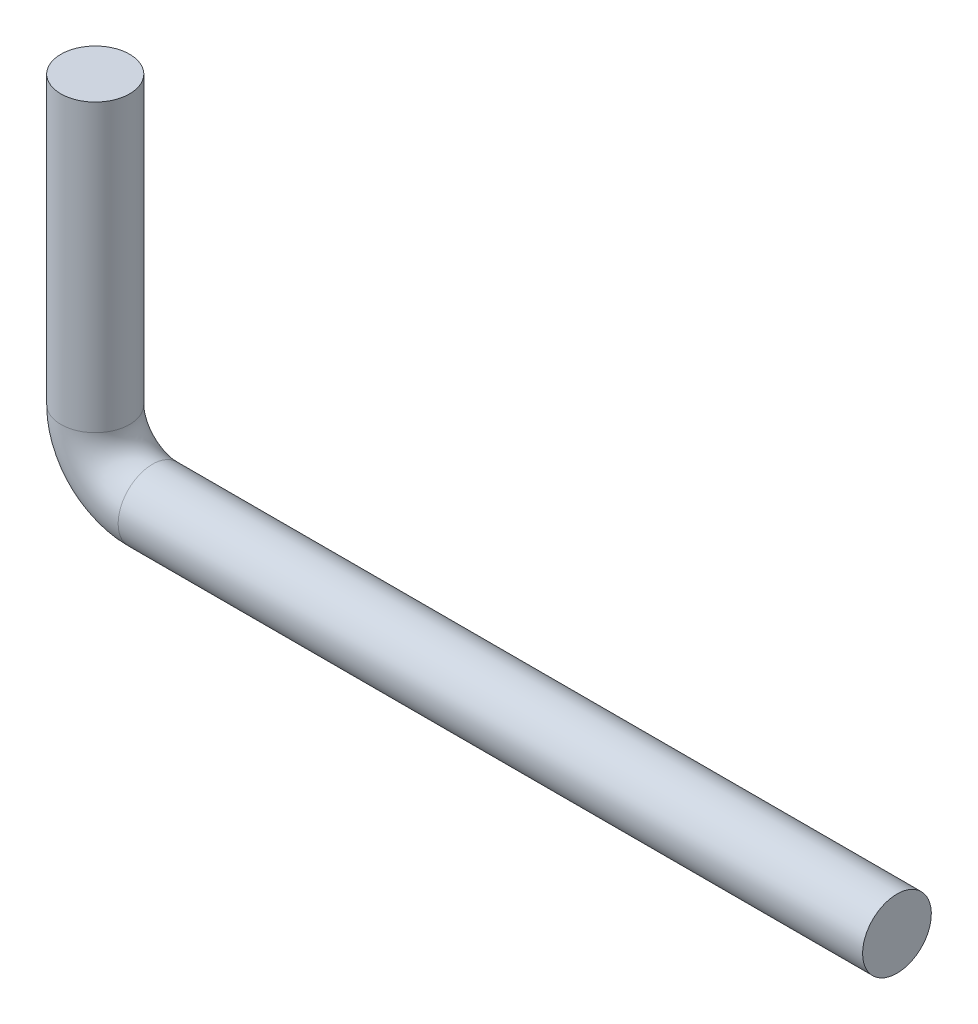
ISO-10303-21;
HEADER;
FILE_DESCRIPTION(('STEP AP214'),'2;1');
FILE_NAME('part.step','',(''),(''),'','','');
FILE_SCHEMA(('AUTOMOTIVE_DESIGN { 1 0 10303 214 1 1 1 1 }'));
ENDSEC;
DATA;
#1=APPLICATION_CONTEXT('core data for automotive mechanical design processes');
#2=APPLICATION_PROTOCOL_DEFINITION('international standard','automotive_design',2000,#1);
#3=PRODUCT_CONTEXT('',#1,'mechanical');
#4=PRODUCT('Part','Part','',(#3));
#5=PRODUCT_RELATED_PRODUCT_CATEGORY('part','',(#4));
#6=PRODUCT_DEFINITION_FORMATION('','',#4);
#7=PRODUCT_DEFINITION_CONTEXT('part definition',#1,'design');
#8=PRODUCT_DEFINITION('design','',#6,#7);
#9=PRODUCT_DEFINITION_SHAPE('','',#8);
#10=(LENGTH_UNIT() NAMED_UNIT(*) SI_UNIT(.MILLI.,.METRE.));
#11=(NAMED_UNIT(*) PLANE_ANGLE_UNIT() SI_UNIT($,.RADIAN.));
#12=(NAMED_UNIT(*) SI_UNIT($,.STERADIAN.) SOLID_ANGLE_UNIT());
#13=UNCERTAINTY_MEASURE_WITH_UNIT(LENGTH_MEASURE(1.E-05),#10,'distance_accuracy_value','');
#14=(GEOMETRIC_REPRESENTATION_CONTEXT(3) GLOBAL_UNCERTAINTY_ASSIGNED_CONTEXT((#13)) GLOBAL_UNIT_ASSIGNED_CONTEXT((#10,
#11,#12)) REPRESENTATION_CONTEXT('',''));
#15=CARTESIAN_POINT('',(0.,0.,0.));
#16=DIRECTION('',(0.,0.,1.));
#17=DIRECTION('',(1.,0.,0.));
#18=AXIS2_PLACEMENT_3D('',#15,#16,#17);
#19=CARTESIAN_POINT('',(0.,60.,0.));
#20=DIRECTION('',(0.,1.,0.));
#21=DIRECTION('',(0.,0.,1.));
#22=AXIS2_PLACEMENT_3D('',#19,#20,#21);
#23=PLANE('',#22);
#24=CARTESIAN_POINT('',(0.,60.,0.));
#25=DIRECTION('',(0.,1.,0.));
#26=DIRECTION('',(0.,0.,1.));
#27=AXIS2_PLACEMENT_3D('',#24,#25,#26);
#28=CIRCLE('',#27,6.);
#29=CARTESIAN_POINT('',(0.,60.,6.));
#30=VERTEX_POINT('',#29);
#31=EDGE_CURVE('E48',#30,#30,#28,.T.);
#32=ORIENTED_EDGE('',*,*,#31,.T.);
#33=EDGE_LOOP('',(#32));
#34=FACE_BOUND('',#33,.T.);
#35=ADVANCED_FACE('F34',(#34),#23,.T.);
#36=CARTESIAN_POINT('',(140.,0.,0.));
#37=DIRECTION('',(-1.,0.,0.));
#38=DIRECTION('',(0.,0.,1.));
#39=AXIS2_PLACEMENT_3D('',#36,#37,#38);
#40=PLANE('',#39);
#41=CARTESIAN_POINT('',(140.,0.,0.));
#42=DIRECTION('',(-1.,0.,0.));
#43=DIRECTION('',(0.,0.,1.));
#44=AXIS2_PLACEMENT_3D('',#41,#42,#43);
#45=CIRCLE('',#44,6.);
#46=CARTESIAN_POINT('',(140.,0.,6.));
#47=VERTEX_POINT('',#46);
#48=EDGE_CURVE('E10',#47,#47,#45,.T.);
#49=ORIENTED_EDGE('',*,*,#48,.F.);
#50=EDGE_LOOP('',(#49));
#51=FACE_BOUND('',#50,.T.);
#52=ADVANCED_FACE('F58',(#51),#40,.F.);
#53=CARTESIAN_POINT('',(0.,60.,0.));
#54=DIRECTION('',(0.,-1.,0.));
#55=DIRECTION('',(0.,0.,-1.));
#56=AXIS2_PLACEMENT_3D('',#53,#54,#55);
#57=CYLINDRICAL_SURFACE('',#56,6.);
#58=CARTESIAN_POINT('',(0.,10.0000000000001,0.));
#59=DIRECTION('',(0.,1.,0.));
#60=DIRECTION('',(0.,0.,1.));
#61=AXIS2_PLACEMENT_3D('',#58,#59,#60);
#62=CIRCLE('',#61,6.);
#63=CARTESIAN_POINT('',(-6.00000000000044,10.0000000000001,0.));
#64=VERTEX_POINT('',#63);
#65=EDGE_CURVE('E44',#64,#64,#62,.T.);
#66=ORIENTED_EDGE('',*,*,#65,.T.);
#67=EDGE_LOOP('',(#66));
#68=FACE_BOUND('',#67,.T.);
#69=ORIENTED_EDGE('',*,*,#31,.F.);
#70=EDGE_LOOP('',(#69));
#71=FACE_BOUND('',#70,.T.);
#72=ADVANCED_FACE('F55',(#68,#71),#57,.T.);
#73=CARTESIAN_POINT('',(10.,10.,0.));
#74=DIRECTION('',(0.,0.,1.));
#75=DIRECTION('',(1.,0.,0.));
#76=AXIS2_PLACEMENT_3D('',#73,#74,#75);
#77=TOROIDAL_SURFACE('',#76,10.0000000000004,6.);
#78=CARTESIAN_POINT('',(10.0000000000001,0.,0.));
#79=DIRECTION('',(-1.,0.,0.));
#80=DIRECTION('',(0.,0.,1.));
#81=AXIS2_PLACEMENT_3D('',#78,#79,#80);
#82=CIRCLE('',#81,6.);
#83=CARTESIAN_POINT('',(10.0000000000001,-6.00000000000044,0.));
#84=VERTEX_POINT('',#83);
#85=EDGE_CURVE('E40',#84,#84,#82,.T.);
#86=CARTESIAN_POINT('',(10.,10.,0.));
#87=DIRECTION('',(0.,0.,1.));
#88=DIRECTION('',(1.,0.,0.));
#89=AXIS2_PLACEMENT_3D('',#86,#87,#88);
#90=CIRCLE('',#89,16.0000000000004);
#91=EDGE_CURVE('',#64,#84,#90,.T.);
#92=ORIENTED_EDGE('',*,*,#65,.F.);
#93=ORIENTED_EDGE('',*,*,#85,.T.);
#94=ORIENTED_EDGE('',*,*,#91,.T.);
#95=ORIENTED_EDGE('',*,*,#91,.F.);
#96=EDGE_LOOP('',(#92,#94,#93,#95));
#97=FACE_BOUND('',#96,.T.);
#98=ADVANCED_FACE('F57',(#97),#77,.T.);
#99=CARTESIAN_POINT('',(10.0000000000001,0.,0.));
#100=DIRECTION('',(1.,0.,0.));
#101=DIRECTION('',(0.,0.,-1.));
#102=AXIS2_PLACEMENT_3D('',#99,#100,#101);
#103=CYLINDRICAL_SURFACE('',#102,6.);
#104=ORIENTED_EDGE('',*,*,#48,.T.);
#105=EDGE_LOOP('',(#104));
#106=FACE_BOUND('',#105,.T.);
#107=ORIENTED_EDGE('',*,*,#85,.F.);
#108=EDGE_LOOP('',(#107));
#109=FACE_BOUND('',#108,.T.);
#110=ADVANCED_FACE('F65',(#106,#109),#103,.T.);
#111=CLOSED_SHELL('',(#35,#52,#72,#98,#110));
#112=MANIFOLD_SOLID_BREP('B2',#111);
#113=ADVANCED_BREP_SHAPE_REPRESENTATION('',(#18,#112),#14);
#114=SHAPE_DEFINITION_REPRESENTATION(#9,#113);
ENDSEC;
END-ISO-10303-21;
